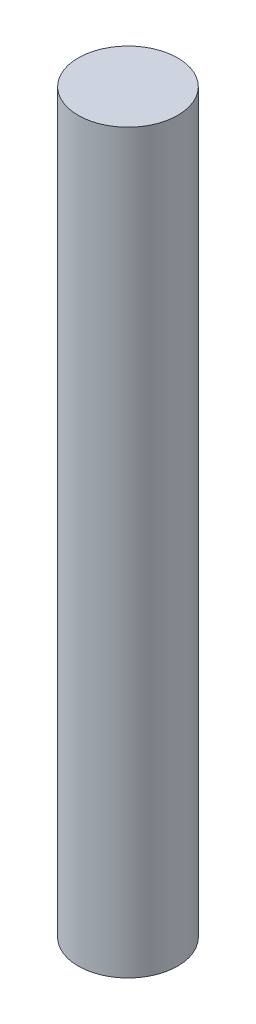
ISO-10303-21;
HEADER;
FILE_DESCRIPTION(('STEP AP214'),'2;1');
FILE_NAME('part.step','',(''),(''),'','','');
FILE_SCHEMA(('AUTOMOTIVE_DESIGN { 1 0 10303 214 1 1 1 1 }'));
ENDSEC;
DATA;
#1=APPLICATION_CONTEXT('core data for automotive mechanical design processes');
#2=APPLICATION_PROTOCOL_DEFINITION('international standard','automotive_design',2000,#1);
#3=PRODUCT_CONTEXT('',#1,'mechanical');
#4=PRODUCT('Part','Part','',(#3));
#5=PRODUCT_RELATED_PRODUCT_CATEGORY('part','',(#4));
#6=PRODUCT_DEFINITION_FORMATION('','',#4);
#7=PRODUCT_DEFINITION_CONTEXT('part definition',#1,'design');
#8=PRODUCT_DEFINITION('design','',#6,#7);
#9=PRODUCT_DEFINITION_SHAPE('','',#8);
#10=(LENGTH_UNIT() NAMED_UNIT(*) SI_UNIT(.MILLI.,.METRE.));
#11=(NAMED_UNIT(*) PLANE_ANGLE_UNIT() SI_UNIT($,.RADIAN.));
#12=(NAMED_UNIT(*) SI_UNIT($,.STERADIAN.) SOLID_ANGLE_UNIT());
#13=UNCERTAINTY_MEASURE_WITH_UNIT(LENGTH_MEASURE(1.E-05),#10,'distance_accuracy_value','');
#14=(GEOMETRIC_REPRESENTATION_CONTEXT(3) GLOBAL_UNCERTAINTY_ASSIGNED_CONTEXT((#13)) GLOBAL_UNIT_ASSIGNED_CONTEXT((#10,
#11,#12)) REPRESENTATION_CONTEXT('',''));
#15=CARTESIAN_POINT('',(0.,0.,0.));
#16=DIRECTION('',(0.,0.,1.));
#17=DIRECTION('',(1.,0.,0.));
#18=AXIS2_PLACEMENT_3D('',#15,#16,#17);
#19=CARTESIAN_POINT('',(0.,118.46,0.));
#20=DIRECTION('',(0.,-1.,0.));
#21=DIRECTION('',(0.,0.,-1.));
#22=AXIS2_PLACEMENT_3D('',#19,#20,#21);
#23=CYLINDRICAL_SURFACE('',#22,8.);
#24=CARTESIAN_POINT('',(0.,118.46,0.));
#25=DIRECTION('',(0.,1.,0.));
#26=DIRECTION('',(0.,0.,1.));
#27=AXIS2_PLACEMENT_3D('',#24,#25,#26);
#28=CIRCLE('',#27,8.);
#29=CARTESIAN_POINT('',(0.,118.46,8.));
#30=VERTEX_POINT('',#29);
#31=EDGE_CURVE('E10',#30,#30,#28,.T.);
#32=ORIENTED_EDGE('',*,*,#31,.F.);
#33=EDGE_LOOP('',(#32));
#34=FACE_BOUND('',#33,.T.);
#35=CARTESIAN_POINT('',(0.,0.,0.));
#36=DIRECTION('',(0.,1.,0.));
#37=DIRECTION('',(0.,0.,1.));
#38=AXIS2_PLACEMENT_3D('',#35,#36,#37);
#39=CIRCLE('',#38,8.);
#40=CARTESIAN_POINT('',(0.,0.,8.));
#41=VERTEX_POINT('',#40);
#42=EDGE_CURVE('E34',#41,#41,#39,.T.);
#43=ORIENTED_EDGE('',*,*,#42,.T.);
#44=EDGE_LOOP('',(#43));
#45=FACE_BOUND('',#44,.T.);
#46=ADVANCED_FACE('F31',(#34,#45),#23,.T.);
#47=CARTESIAN_POINT('',(0.,118.46,0.));
#48=DIRECTION('',(0.,1.,0.));
#49=DIRECTION('',(0.,0.,1.));
#50=AXIS2_PLACEMENT_3D('',#47,#48,#49);
#51=PLANE('',#50);
#52=ORIENTED_EDGE('',*,*,#31,.T.);
#53=EDGE_LOOP('',(#52));
#54=FACE_BOUND('',#53,.T.);
#55=ADVANCED_FACE('F46',(#54),#51,.T.);
#56=CARTESIAN_POINT('',(0.,0.,0.));
#57=DIRECTION('',(0.,1.,0.));
#58=DIRECTION('',(0.,0.,1.));
#59=AXIS2_PLACEMENT_3D('',#56,#57,#58);
#60=PLANE('',#59);
#61=ORIENTED_EDGE('',*,*,#42,.F.);
#62=EDGE_LOOP('',(#61));
#63=FACE_BOUND('',#62,.T.);
#64=ADVANCED_FACE('F44',(#63),#60,.F.);
#65=CLOSED_SHELL('',(#46,#55,#64));
#66=MANIFOLD_SOLID_BREP('B2',#65);
#67=ADVANCED_BREP_SHAPE_REPRESENTATION('',(#18,#66),#14);
#68=SHAPE_DEFINITION_REPRESENTATION(#9,#67);
ENDSEC;
END-ISO-10303-21;
